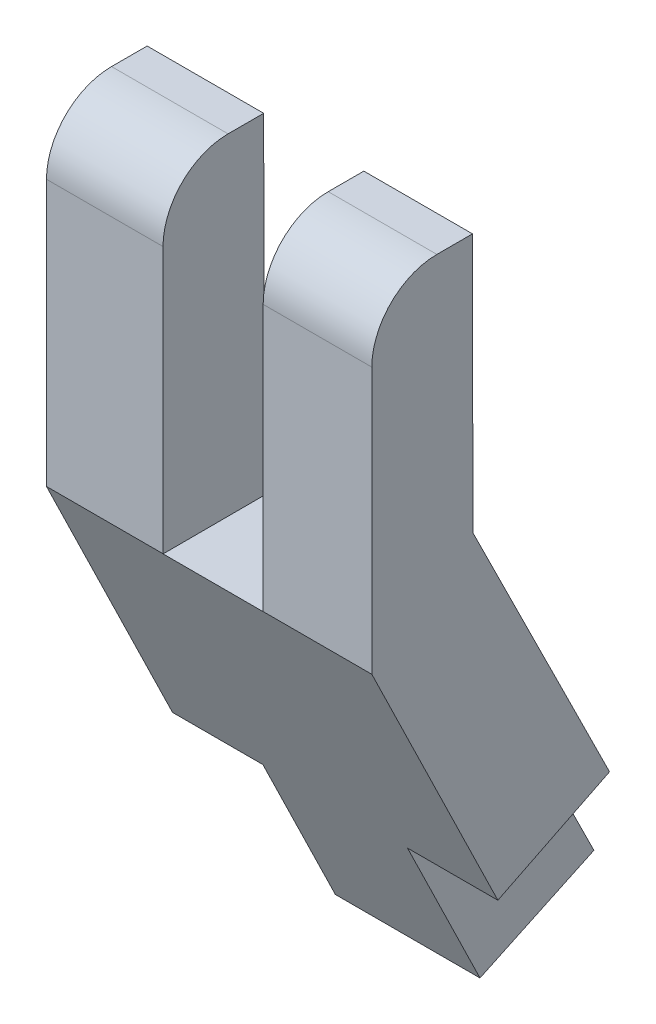
ISO-10303-21;
HEADER;
FILE_DESCRIPTION(('STEP AP214'),'2;1');
FILE_NAME('part.step','',(''),(''),'','','');
FILE_SCHEMA(('AUTOMOTIVE_DESIGN { 1 0 10303 214 1 1 1 1 }'));
ENDSEC;
DATA;
#1=APPLICATION_CONTEXT('core data for automotive mechanical design processes');
#2=APPLICATION_PROTOCOL_DEFINITION('international standard','automotive_design',2000,#1);
#3=PRODUCT_CONTEXT('',#1,'mechanical');
#4=PRODUCT('Part','Part','',(#3));
#5=PRODUCT_RELATED_PRODUCT_CATEGORY('part','',(#4));
#6=PRODUCT_DEFINITION_FORMATION('','',#4);
#7=PRODUCT_DEFINITION_CONTEXT('part definition',#1,'design');
#8=PRODUCT_DEFINITION('design','',#6,#7);
#9=PRODUCT_DEFINITION_SHAPE('','',#8);
#10=(LENGTH_UNIT() NAMED_UNIT(*) SI_UNIT(.MILLI.,.METRE.));
#11=(NAMED_UNIT(*) PLANE_ANGLE_UNIT() SI_UNIT($,.RADIAN.));
#12=(NAMED_UNIT(*) SI_UNIT($,.STERADIAN.) SOLID_ANGLE_UNIT());
#13=UNCERTAINTY_MEASURE_WITH_UNIT(LENGTH_MEASURE(1.E-05),#10,'distance_accuracy_value','');
#14=(GEOMETRIC_REPRESENTATION_CONTEXT(3) GLOBAL_UNCERTAINTY_ASSIGNED_CONTEXT((#13)) GLOBAL_UNIT_ASSIGNED_CONTEXT((#10,
#11,#12)) REPRESENTATION_CONTEXT('',''));
#15=CARTESIAN_POINT('',(0.,0.,0.));
#16=DIRECTION('',(0.,0.,1.));
#17=DIRECTION('',(1.,0.,0.));
#18=AXIS2_PLACEMENT_3D('',#15,#16,#17);
#19=CARTESIAN_POINT('',(4.5,3.04292614968411,3.83808043067269));
#20=DIRECTION('',(0.,0.438003630054975,-0.898973203192768));
#21=DIRECTION('',(0.,0.898973203192768,0.438003630054975));
#22=AXIS2_PLACEMENT_3D('',#19,#20,#21);
#23=PLANE('',#22);
#24=DIRECTION('',(0.,-0.898973203192768,-0.438003630054975));
#25=VECTOR('',#24,1.);
#26=CARTESIAN_POINT('',(3.25,5.08393885452834,4.83251604959335));
#27=LINE('',#26,#25);
#28=CARTESIAN_POINT('',(3.25,5.10041129322718,4.84054185939539));
#29=VERTEX_POINT('',#28);
#30=CARTESIAN_POINT('',(3.25,3.04292614968411,3.83808043067269));
#31=VERTEX_POINT('',#30);
#32=EDGE_CURVE('E168',#29,#31,#27,.T.);
#33=ORIENTED_EDGE('',*,*,#32,.F.);
#34=DIRECTION('',(-1.,0.,0.));
#35=VECTOR('',#34,1.);
#36=CARTESIAN_POINT('',(3.25,5.10041129322718,4.84054185939539));
#37=LINE('',#36,#35);
#38=CARTESIAN_POINT('',(4.5,5.10041129322718,4.84054185939539));
#39=VERTEX_POINT('',#38);
#40=EDGE_CURVE('E163',#39,#29,#37,.T.);
#41=ORIENTED_EDGE('',*,*,#40,.F.);
#42=DIRECTION('',(0.,-0.898973203192767,-0.438003630054975));
#43=VECTOR('',#42,1.);
#44=CARTESIAN_POINT('',(4.5,3.04292614968411,3.83808043067269));
#45=LINE('',#44,#43);
#46=CARTESIAN_POINT('',(4.5,8.67889158146946,6.58407253501909));
#47=VERTEX_POINT('',#46);
#48=EDGE_CURVE('E175',#47,#39,#45,.T.);
#49=ORIENTED_EDGE('',*,*,#48,.F.);
#50=DIRECTION('',(-1.,0.,0.));
#51=VECTOR('',#50,1.);
#52=CARTESIAN_POINT('',(4.5,8.67889158146946,6.58407253501909));
#53=LINE('',#52,#51);
#54=CARTESIAN_POINT('',(2.99704549335491,8.67889158146946,6.58407253501909));
#55=VERTEX_POINT('',#54);
#56=EDGE_CURVE('E211',#47,#55,#53,.T.);
#57=ORIENTED_EDGE('',*,*,#56,.T.);
#58=DIRECTION('',(0.,0.898973203192768,0.438003630054975));
#59=VECTOR('',#58,1.);
#60=CARTESIAN_POINT('',(2.9970454933549,8.68151642383623,6.58535142796149));
#61=LINE('',#60,#59);
#62=CARTESIAN_POINT('',(2.9970454933549,8.67594496847378,6.58263686687694));
#63=VERTEX_POINT('',#62);
#64=EDGE_CURVE('E259',#63,#55,#61,.T.);
#65=ORIENTED_EDGE('',*,*,#64,.F.);
#66=DIRECTION('',(1.,0.,0.));
#67=VECTOR('',#66,1.);
#68=CARTESIAN_POINT('',(2.9970454933549,8.67594496847378,6.58263686687694));
#69=LINE('',#68,#67);
#70=CARTESIAN_POINT('',(1.61182585498931,8.67594496847378,6.58263686687694));
#71=VERTEX_POINT('',#70);
#72=EDGE_CURVE('E260',#71,#63,#69,.T.);
#73=ORIENTED_EDGE('',*,*,#72,.F.);
#74=DIRECTION('',(0.,-0.898973203192768,-0.438003630054975));
#75=VECTOR('',#74,1.);
#76=CARTESIAN_POINT('',(1.61182585498931,8.68151642383623,6.58535142796149));
#77=LINE('',#76,#75);
#78=CARTESIAN_POINT('',(1.61182585498931,8.67889158146946,6.58407253501909));
#79=VERTEX_POINT('',#78);
#80=EDGE_CURVE('E272',#79,#71,#77,.T.);
#81=ORIENTED_EDGE('',*,*,#80,.F.);
#82=CARTESIAN_POINT('',(0.,8.67889158146946,6.58407253501909));
#83=VERTEX_POINT('',#82);
#84=EDGE_CURVE('E200',#79,#83,#53,.T.);
#85=ORIENTED_EDGE('',*,*,#84,.T.);
#86=DIRECTION('',(0.,-0.898973203192767,-0.438003630054975));
#87=VECTOR('',#86,1.);
#88=CARTESIAN_POINT('',(0.,3.04292614968411,3.83808043067269));
#89=LINE('',#88,#87);
#90=CARTESIAN_POINT('',(0.,5.10041129322718,4.84054185939539));
#91=VERTEX_POINT('',#90);
#92=EDGE_CURVE('E201',#83,#91,#89,.T.);
#93=ORIENTED_EDGE('',*,*,#92,.T.);
#94=DIRECTION('',(-1.,0.,0.));
#95=VECTOR('',#94,1.);
#96=CARTESIAN_POINT('',(1.25,5.10041129322718,4.84054185939539));
#97=LINE('',#96,#95);
#98=CARTESIAN_POINT('',(1.25,5.10041129322718,4.84054185939539));
#99=VERTEX_POINT('',#98);
#100=EDGE_CURVE('E61',#99,#91,#97,.T.);
#101=ORIENTED_EDGE('',*,*,#100,.F.);
#102=DIRECTION('',(0.,0.898973203192768,0.438003630054975));
#103=VECTOR('',#102,1.);
#104=CARTESIAN_POINT('',(1.25,5.08393885452834,4.83251604959335));
#105=LINE('',#104,#103);
#106=CARTESIAN_POINT('',(1.25,3.04292614968411,3.83808043067269));
#107=VERTEX_POINT('',#106);
#108=EDGE_CURVE('E476',#107,#99,#105,.T.);
#109=ORIENTED_EDGE('',*,*,#108,.F.);
#110=DIRECTION('',(-1.,0.,0.));
#111=VECTOR('',#110,1.);
#112=CARTESIAN_POINT('',(4.5,3.04292614968411,3.83808043067269));
#113=LINE('',#112,#111);
#114=EDGE_CURVE('E223',#31,#107,#113,.T.);
#115=ORIENTED_EDGE('',*,*,#114,.F.);
#116=EDGE_LOOP('',(#33,#41,#49,#57,#65,#73,#81,#85,#93,#101,#109,#115));
#117=FACE_BOUND('',#116,.T.);
#118=ADVANCED_FACE('F38',(#117),#23,.F.);
#119=CARTESIAN_POINT('',(4.5,3.78454922949705,2.26252963071506));
#120=DIRECTION('',(0.,-0.44463945806678,0.895709636171277));
#121=DIRECTION('',(0.,-0.895709636171277,-0.44463945806678));
#122=AXIS2_PLACEMENT_3D('',#119,#120,#121);
#123=PLANE('',#122);
#124=DIRECTION('',(0.,0.895709636171277,0.44463945806678));
#125=VECTOR('',#124,1.);
#126=CARTESIAN_POINT('',(4.5,3.78454922949705,2.26252963071506));
#127=LINE('',#126,#125);
#128=CARTESIAN_POINT('',(4.5,5.86699915428375,3.2962791502204));
#129=VERTEX_POINT('',#128);
#130=CARTESIAN_POINT('',(4.5,9.6740785639389,5.18615244974419));
#131=VERTEX_POINT('',#130);
#132=EDGE_CURVE('E184',#129,#131,#127,.T.);
#133=ORIENTED_EDGE('',*,*,#132,.F.);
#134=DIRECTION('',(1.,0.,0.));
#135=VECTOR('',#134,1.);
#136=CARTESIAN_POINT('',(3.25,5.86699915428375,3.2962791502204));
#137=LINE('',#136,#135);
#138=CARTESIAN_POINT('',(3.25,5.86699915428375,3.2962791502204));
#139=VERTEX_POINT('',#138);
#140=EDGE_CURVE('E53',#139,#129,#137,.T.);
#141=ORIENTED_EDGE('',*,*,#140,.F.);
#142=DIRECTION('',(0.,0.895709636171277,0.44463945806678));
#143=VECTOR('',#142,1.);
#144=CARTESIAN_POINT('',(3.25,5.86699915428375,3.2962791502204));
#145=LINE('',#144,#143);
#146=CARTESIAN_POINT('',(3.25,3.78454922949705,2.26252963071506));
#147=VERTEX_POINT('',#146);
#148=EDGE_CURVE('E177',#147,#139,#145,.T.);
#149=ORIENTED_EDGE('',*,*,#148,.F.);
#150=DIRECTION('',(-1.,0.,0.));
#151=VECTOR('',#150,1.);
#152=CARTESIAN_POINT('',(4.5,3.78454922949705,2.26252963071506));
#153=LINE('',#152,#151);
#154=CARTESIAN_POINT('',(1.25,3.78454922949705,2.26252963071506));
#155=VERTEX_POINT('',#154);
#156=EDGE_CURVE('E221',#147,#155,#153,.T.);
#157=ORIENTED_EDGE('',*,*,#156,.T.);
#158=DIRECTION('',(0.,-0.895709636171277,-0.44463945806678));
#159=VECTOR('',#158,1.);
#160=CARTESIAN_POINT('',(1.25,5.86699915428375,3.2962791502204));
#161=LINE('',#160,#159);
#162=CARTESIAN_POINT('',(1.25,5.86699915428375,3.2962791502204));
#163=VERTEX_POINT('',#162);
#164=EDGE_CURVE('E478',#163,#155,#161,.T.);
#165=ORIENTED_EDGE('',*,*,#164,.F.);
#166=DIRECTION('',(1.,0.,0.));
#167=VECTOR('',#166,1.);
#168=CARTESIAN_POINT('',(1.25,5.86699915428375,3.2962791502204));
#169=LINE('',#168,#167);
#170=CARTESIAN_POINT('',(0.,5.86699915428375,3.2962791502204));
#171=VERTEX_POINT('',#170);
#172=EDGE_CURVE('E306',#171,#163,#169,.T.);
#173=ORIENTED_EDGE('',*,*,#172,.F.);
#174=DIRECTION('',(0.,0.895709636171277,0.44463945806678));
#175=VECTOR('',#174,1.);
#176=CARTESIAN_POINT('',(0.,3.78454922949705,2.26252963071506));
#177=LINE('',#176,#175);
#178=CARTESIAN_POINT('',(0.,9.6740785639389,5.18615244974419));
#179=VERTEX_POINT('',#178);
#180=EDGE_CURVE('E204',#171,#179,#177,.T.);
#181=ORIENTED_EDGE('',*,*,#180,.T.);
#182=DIRECTION('',(-1.,0.,0.));
#183=VECTOR('',#182,1.);
#184=CARTESIAN_POINT('',(4.5,9.6740785639389,5.18615244974419));
#185=LINE('',#184,#183);
#186=CARTESIAN_POINT('',(1.61182585498931,9.6740785639389,5.18615244974419));
#187=VERTEX_POINT('',#186);
#188=EDGE_CURVE('E217',#187,#179,#185,.T.);
#189=ORIENTED_EDGE('',*,*,#188,.F.);
#190=DIRECTION('',(0.,0.895709636171277,0.44463945806678));
#191=VECTOR('',#190,1.);
#192=CARTESIAN_POINT('',(1.61182585498931,3.78454922949705,2.26252963071506));
#193=LINE('',#192,#191);
#194=CARTESIAN_POINT('',(1.61182585498931,8.67989503427929,4.69262954009198));
#195=VERTEX_POINT('',#194);
#196=EDGE_CURVE('E192',#195,#187,#193,.T.);
#197=ORIENTED_EDGE('',*,*,#196,.F.);
#198=DIRECTION('',(-1.,0.,0.));
#199=VECTOR('',#198,1.);
#200=CARTESIAN_POINT('',(4.5,8.67989503427929,4.69262954009198));
#201=LINE('',#200,#199);
#202=CARTESIAN_POINT('',(2.9970454933549,8.67989503427929,4.69262954009198));
#203=VERTEX_POINT('',#202);
#204=EDGE_CURVE('E225',#203,#195,#201,.T.);
#205=ORIENTED_EDGE('',*,*,#204,.F.);
#206=DIRECTION('',(0.,-0.895709636171277,-0.44463945806678));
#207=VECTOR('',#206,1.);
#208=CARTESIAN_POINT('',(2.99704549335489,3.78454922949705,2.26252963071506));
#209=LINE('',#208,#207);
#210=CARTESIAN_POINT('',(2.99704549335491,9.6740785639389,5.18615244974419));
#211=VERTEX_POINT('',#210);
#212=EDGE_CURVE('E282',#211,#203,#209,.T.);
#213=ORIENTED_EDGE('',*,*,#212,.F.);
#214=EDGE_CURVE('E218',#131,#211,#185,.T.);
#215=ORIENTED_EDGE('',*,*,#214,.F.);
#216=EDGE_LOOP('',(#133,#141,#149,#157,#165,#173,#181,#189,#197,#205,#213,#215));
#217=FACE_BOUND('',#216,.T.);
#218=ADVANCED_FACE('F301',(#217),#123,.F.);
#219=CARTESIAN_POINT('',(4.5,13.2582341197999,5.19154385418615));
#220=DIRECTION('',(0.,-0.00150423112455125,0.999998868643722));
#221=DIRECTION('',(0.,-0.999998868643722,-0.00150423112455125));
#222=AXIS2_PLACEMENT_3D('',#219,#220,#221);
#223=PLANE('',#222);
#224=DIRECTION('',(0.,0.999998868643722,0.00150423112455125));
#225=VECTOR('',#224,1.);
#226=CARTESIAN_POINT('',(1.61182585498931,13.2582341197999,5.19154385418615));
#227=LINE('',#226,#225);
#228=CARTESIAN_POINT('',(1.61182585498931,13.2582341197999,5.19154385418615));
#229=VERTEX_POINT('',#228);
#230=EDGE_CURVE('E286',#187,#229,#227,.T.);
#231=ORIENTED_EDGE('',*,*,#230,.F.);
#232=ORIENTED_EDGE('',*,*,#188,.T.);
#233=DIRECTION('',(0.,0.999998868643722,0.00150423112455125));
#234=VECTOR('',#233,1.);
#235=CARTESIAN_POINT('',(0.,13.2582341197999,5.19154385418615));
#236=LINE('',#235,#234);
#237=CARTESIAN_POINT('',(0.,13.2582341197999,5.19154385418615));
#238=VERTEX_POINT('',#237);
#239=EDGE_CURVE('E206',#179,#238,#236,.T.);
#240=ORIENTED_EDGE('',*,*,#239,.T.);
#241=DIRECTION('',(-1.,0.,0.));
#242=VECTOR('',#241,1.);
#243=CARTESIAN_POINT('',(4.5,13.2582341197999,5.19154385418615));
#244=LINE('',#243,#242);
#245=EDGE_CURVE('E213',#229,#238,#244,.T.);
#246=ORIENTED_EDGE('',*,*,#245,.F.);
#247=EDGE_LOOP('',(#231,#232,#240,#246));
#248=FACE_BOUND('',#247,.T.);
#249=ADVANCED_FACE('F299',(#248),#223,.F.);
#250=DIRECTION('',(0.,-0.999998868643722,-0.00150423112455125));
#251=VECTOR('',#250,1.);
#252=CARTESIAN_POINT('',(2.99704549335492,13.2582341197999,5.19154385418615));
#253=LINE('',#252,#251);
#254=CARTESIAN_POINT('',(2.99704549335492,13.2582341197999,5.19154385418615));
#255=VERTEX_POINT('',#254);
#256=EDGE_CURVE('E280',#255,#211,#253,.T.);
#257=ORIENTED_EDGE('',*,*,#256,.F.);
#258=CARTESIAN_POINT('',(4.5,13.2582341197999,5.19154385418615));
#259=VERTEX_POINT('',#258);
#260=EDGE_CURVE('E214',#259,#255,#244,.T.);
#261=ORIENTED_EDGE('',*,*,#260,.F.);
#262=DIRECTION('',(0.,0.999998868643722,0.00150423112455125));
#263=VECTOR('',#262,1.);
#264=CARTESIAN_POINT('',(4.5,13.2582341197999,5.19154385418615));
#265=LINE('',#264,#263);
#266=EDGE_CURVE('E187',#131,#259,#265,.T.);
#267=ORIENTED_EDGE('',*,*,#266,.F.);
#268=ORIENTED_EDGE('',*,*,#214,.T.);
#269=EDGE_LOOP('',(#257,#261,#267,#268));
#270=FACE_BOUND('',#269,.T.);
#271=ADVANCED_FACE('F333',(#270),#223,.F.);
#272=CARTESIAN_POINT('',(4.5,13.2582341197999,6.58407253501905));
#273=DIRECTION('',(0.,-1.,0.));
#274=DIRECTION('',(0.,0.,-1.));
#275=AXIS2_PLACEMENT_3D('',#272,#273,#274);
#276=PLANE('',#275);
#277=DIRECTION('',(0.,0.,1.));
#278=VECTOR('',#277,1.);
#279=CARTESIAN_POINT('',(0.,13.2582341197999,6.58407253501905));
#280=LINE('',#279,#278);
#281=CARTESIAN_POINT('',(0.,13.2582341197999,5.68407253501906));
#282=VERTEX_POINT('',#281);
#283=EDGE_CURVE('E189',#238,#282,#280,.T.);
#284=ORIENTED_EDGE('',*,*,#283,.T.);
#285=DIRECTION('',(-1.,0.,0.));
#286=VECTOR('',#285,1.);
#287=CARTESIAN_POINT('',(4.5,13.2582341197999,5.68407253501906));
#288=LINE('',#287,#286);
#289=CARTESIAN_POINT('',(1.61182585498931,13.2582341197999,5.68407253501906));
#290=VERTEX_POINT('',#289);
#291=EDGE_CURVE('E232',#282,#290,#288,.F.);
#292=ORIENTED_EDGE('',*,*,#291,.T.);
#293=DIRECTION('',(0.,0.,1.));
#294=VECTOR('',#293,1.);
#295=CARTESIAN_POINT('',(1.61182585498931,13.2582341197999,6.58407253501905));
#296=LINE('',#295,#294);
#297=EDGE_CURVE('E284',#229,#290,#296,.T.);
#298=ORIENTED_EDGE('',*,*,#297,.F.);
#299=ORIENTED_EDGE('',*,*,#245,.T.);
#300=EDGE_LOOP('',(#284,#292,#298,#299));
#301=FACE_BOUND('',#300,.T.);
#302=ADVANCED_FACE('F314',(#301),#276,.F.);
#303=DIRECTION('',(0.,0.,-1.));
#304=VECTOR('',#303,1.);
#305=CARTESIAN_POINT('',(2.99704549335492,13.2582341197999,6.58407253501905));
#306=LINE('',#305,#304);
#307=CARTESIAN_POINT('',(2.99704549335492,13.2582341197999,5.68407253501906));
#308=VERTEX_POINT('',#307);
#309=EDGE_CURVE('E245',#308,#255,#306,.T.);
#310=ORIENTED_EDGE('',*,*,#309,.F.);
#311=DIRECTION('',(-1.,0.,0.));
#312=VECTOR('',#311,1.);
#313=CARTESIAN_POINT('',(4.5,13.2582341197999,5.68407253501906));
#314=LINE('',#313,#312);
#315=CARTESIAN_POINT('',(4.5,13.2582341197999,5.68407253501906));
#316=VERTEX_POINT('',#315);
#317=EDGE_CURVE('E46',#308,#316,#314,.F.);
#318=ORIENTED_EDGE('',*,*,#317,.T.);
#319=DIRECTION('',(0.,0.,1.));
#320=VECTOR('',#319,1.);
#321=CARTESIAN_POINT('',(4.5,13.2582341197999,6.58407253501905));
#322=LINE('',#321,#320);
#323=EDGE_CURVE('E196',#259,#316,#322,.T.);
#324=ORIENTED_EDGE('',*,*,#323,.F.);
#325=ORIENTED_EDGE('',*,*,#260,.T.);
#326=EDGE_LOOP('',(#310,#318,#324,#325));
#327=FACE_BOUND('',#326,.T.);
#328=ADVANCED_FACE('F244',(#327),#276,.F.);
#329=CARTESIAN_POINT('',(4.5,8.67889158146946,6.58407253501909));
#330=DIRECTION('',(0.,0.,-1.));
#331=DIRECTION('',(0.,1.,0.));
#332=AXIS2_PLACEMENT_3D('',#329,#330,#331);
#333=PLANE('',#332);
#334=DIRECTION('',(0.,-1.,0.));
#335=VECTOR('',#334,1.);
#336=CARTESIAN_POINT('',(1.61182585498931,8.67591526878016,6.58407253501909));
#337=LINE('',#336,#335);
#338=CARTESIAN_POINT('',(1.61182585498931,12.3582341197999,6.58407253501906));
#339=VERTEX_POINT('',#338);
#340=EDGE_CURVE('E270',#339,#79,#337,.T.);
#341=ORIENTED_EDGE('',*,*,#340,.F.);
#342=DIRECTION('',(-1.,0.,0.));
#343=VECTOR('',#342,1.);
#344=CARTESIAN_POINT('',(4.5,12.3582341197999,6.58407253501906));
#345=LINE('',#344,#343);
#346=CARTESIAN_POINT('',(0.,12.3582341197999,6.58407253501906));
#347=VERTEX_POINT('',#346);
#348=EDGE_CURVE('E227',#339,#347,#345,.T.);
#349=ORIENTED_EDGE('',*,*,#348,.T.);
#350=DIRECTION('',(0.,-1.,0.));
#351=VECTOR('',#350,1.);
#352=CARTESIAN_POINT('',(0.,8.67889158146946,6.58407253501909));
#353=LINE('',#352,#351);
#354=EDGE_CURVE('E185',#347,#83,#353,.T.);
#355=ORIENTED_EDGE('',*,*,#354,.T.);
#356=ORIENTED_EDGE('',*,*,#84,.F.);
#357=EDGE_LOOP('',(#341,#349,#355,#356));
#358=FACE_BOUND('',#357,.T.);
#359=ADVANCED_FACE('F323',(#358),#333,.F.);
#360=DIRECTION('',(0.,-1.,0.));
#361=VECTOR('',#360,1.);
#362=CARTESIAN_POINT('',(4.5,8.67889158146946,6.58407253501909));
#363=LINE('',#362,#361);
#364=CARTESIAN_POINT('',(4.5,12.3582341197999,6.58407253501906));
#365=VERTEX_POINT('',#364);
#366=EDGE_CURVE('E182',#365,#47,#363,.T.);
#367=ORIENTED_EDGE('',*,*,#366,.F.);
#368=DIRECTION('',(-1.,0.,0.));
#369=VECTOR('',#368,1.);
#370=CARTESIAN_POINT('',(4.5,12.3582341197999,6.58407253501906));
#371=LINE('',#370,#369);
#372=CARTESIAN_POINT('',(2.99704549335491,12.3582341197999,6.58407253501906));
#373=VERTEX_POINT('',#372);
#374=EDGE_CURVE('E236',#365,#373,#371,.T.);
#375=ORIENTED_EDGE('',*,*,#374,.T.);
#376=DIRECTION('',(0.,1.,0.));
#377=VECTOR('',#376,1.);
#378=CARTESIAN_POINT('',(2.9970454933549,8.67591526878016,6.58407253501909));
#379=LINE('',#378,#377);
#380=EDGE_CURVE('E255',#55,#373,#379,.T.);
#381=ORIENTED_EDGE('',*,*,#380,.F.);
#382=ORIENTED_EDGE('',*,*,#56,.F.);
#383=EDGE_LOOP('',(#367,#375,#381,#382));
#384=FACE_BOUND('',#383,.T.);
#385=ADVANCED_FACE('F254',(#384),#333,.F.);
#386=CARTESIAN_POINT('',(4.5,3.78454922949705,2.26252963071506));
#387=DIRECTION('',(0.,0.904777234553414,0.425885143945966));
#388=DIRECTION('',(0.,-0.425885143945966,0.904777234553414));
#389=AXIS2_PLACEMENT_3D('',#386,#387,#388);
#390=PLANE('',#389);
#391=ORIENTED_EDGE('',*,*,#156,.F.);
#392=DIRECTION('',(0.,0.425885143945966,-0.904777234553414));
#393=VECTOR('',#392,1.);
#394=CARTESIAN_POINT('',(3.25,1.97476747601769,6.1073440210147));
#395=LINE('',#394,#393);
#396=EDGE_CURVE('E178',#31,#147,#395,.T.);
#397=ORIENTED_EDGE('',*,*,#396,.F.);
#398=ORIENTED_EDGE('',*,*,#114,.T.);
#399=DIRECTION('',(0.,-0.425885143945966,0.904777234553414));
#400=VECTOR('',#399,1.);
#401=CARTESIAN_POINT('',(1.25,1.97476747601769,6.1073440210147));
#402=LINE('',#401,#400);
#403=EDGE_CURVE('E469',#155,#107,#402,.T.);
#404=ORIENTED_EDGE('',*,*,#403,.F.);
#405=EDGE_LOOP('',(#391,#397,#398,#404));
#406=FACE_BOUND('',#405,.T.);
#407=ADVANCED_FACE('F348',(#406),#390,.F.);
#408=CARTESIAN_POINT('',(4.5,0.,0.));
#409=DIRECTION('',(1.,0.,0.));
#410=DIRECTION('',(0.,0.,-1.));
#411=AXIS2_PLACEMENT_3D('',#408,#409,#410);
#412=PLANE('',#411);
#413=DIRECTION('',(0.,0.44463945806678,-0.895709636171277));
#414=VECTOR('',#413,1.);
#415=CARTESIAN_POINT('',(4.5,3.99864956000666,7.05999985689539));
#416=LINE('',#415,#414);
#417=EDGE_CURVE('E160',#39,#129,#416,.T.);
#418=ORIENTED_EDGE('',*,*,#417,.T.);
#419=ORIENTED_EDGE('',*,*,#132,.T.);
#420=ORIENTED_EDGE('',*,*,#266,.T.);
#421=ORIENTED_EDGE('',*,*,#323,.T.);
#422=CARTESIAN_POINT('',(4.5,12.3582341197999,5.68407253501906));
#423=DIRECTION('',(1.,0.,0.));
#424=DIRECTION('',(0.,0.,-1.));
#425=AXIS2_PLACEMENT_3D('',#422,#423,#424);
#426=CIRCLE('',#425,0.9);
#427=EDGE_CURVE('E11',#316,#365,#426,.T.);
#428=ORIENTED_EDGE('',*,*,#427,.T.);
#429=ORIENTED_EDGE('',*,*,#366,.T.);
#430=ORIENTED_EDGE('',*,*,#48,.T.);
#431=EDGE_LOOP('',(#418,#419,#420,#421,#428,#429,#430));
#432=FACE_BOUND('',#431,.T.);
#433=ADVANCED_FACE('F180',(#432),#412,.T.);
#434=CARTESIAN_POINT('',(0.,0.,0.));
#435=DIRECTION('',(1.,0.,0.));
#436=DIRECTION('',(0.,0.,-1.));
#437=AXIS2_PLACEMENT_3D('',#434,#435,#436);
#438=PLANE('',#437);
#439=ORIENTED_EDGE('',*,*,#180,.F.);
#440=DIRECTION('',(0.,0.44463945806678,-0.895709636171277));
#441=VECTOR('',#440,1.);
#442=CARTESIAN_POINT('',(0.,3.99864956000666,7.05999985689539));
#443=LINE('',#442,#441);
#444=EDGE_CURVE('E265',#91,#171,#443,.T.);
#445=ORIENTED_EDGE('',*,*,#444,.F.);
#446=ORIENTED_EDGE('',*,*,#92,.F.);
#447=ORIENTED_EDGE('',*,*,#354,.F.);
#448=CARTESIAN_POINT('',(0.,12.3582341197999,5.68407253501906));
#449=DIRECTION('',(1.,0.,0.));
#450=DIRECTION('',(0.,0.,-1.));
#451=AXIS2_PLACEMENT_3D('',#448,#449,#450);
#452=CIRCLE('',#451,0.9);
#453=EDGE_CURVE('E230',#347,#282,#452,.F.);
#454=ORIENTED_EDGE('',*,*,#453,.T.);
#455=ORIENTED_EDGE('',*,*,#283,.F.);
#456=ORIENTED_EDGE('',*,*,#239,.F.);
#457=EDGE_LOOP('',(#439,#445,#446,#447,#454,#455,#456));
#458=FACE_BOUND('',#457,.T.);
#459=ADVANCED_FACE('F308',(#458),#438,.F.);
#460=CARTESIAN_POINT('',(2.9970454933549,8.68827279298161,0.684082313537499));
#461=DIRECTION('',(0.,0.999997816011901,0.00208996924119805));
#462=DIRECTION('',(0.,-0.00208996924119805,0.999997816011901));
#463=AXIS2_PLACEMENT_3D('',#460,#461,#462);
#464=PLANE('',#463);
#465=ORIENTED_EDGE('',*,*,#204,.T.);
#466=DIRECTION('',(0.,-0.00208996924119805,0.9999978160119));
#467=VECTOR('',#466,1.);
#468=CARTESIAN_POINT('',(1.61182585498931,8.68827279298161,0.684082313537499));
#469=LINE('',#468,#467);
#470=EDGE_CURVE('E277',#195,#71,#469,.T.);
#471=ORIENTED_EDGE('',*,*,#470,.T.);
#472=ORIENTED_EDGE('',*,*,#72,.T.);
#473=DIRECTION('',(0.,-0.00208996924119805,0.9999978160119));
#474=VECTOR('',#473,1.);
#475=CARTESIAN_POINT('',(2.9970454933549,8.68827279298161,0.684082313537499));
#476=LINE('',#475,#474);
#477=EDGE_CURVE('E275',#203,#63,#476,.T.);
#478=ORIENTED_EDGE('',*,*,#477,.F.);
#479=EDGE_LOOP('',(#465,#471,#472,#478));
#480=FACE_BOUND('',#479,.T.);
#481=ADVANCED_FACE('F328',(#480),#464,.T.);
#482=CARTESIAN_POINT('',(1.61182585498931,8.68827279298161,0.684082313537499));
#483=DIRECTION('',(1.,0.,0.));
#484=DIRECTION('',(0.,0.,-1.));
#485=AXIS2_PLACEMENT_3D('',#482,#483,#484);
#486=PLANE('',#485);
#487=ORIENTED_EDGE('',*,*,#297,.T.);
#488=CARTESIAN_POINT('',(1.61182585498931,12.3582341197999,5.68407253501906));
#489=DIRECTION('',(1.,0.,0.));
#490=DIRECTION('',(0.,0.,-1.));
#491=AXIS2_PLACEMENT_3D('',#488,#489,#490);
#492=CIRCLE('',#491,0.9);
#493=EDGE_CURVE('E234',#290,#339,#492,.T.);
#494=ORIENTED_EDGE('',*,*,#493,.T.);
#495=ORIENTED_EDGE('',*,*,#340,.T.);
#496=ORIENTED_EDGE('',*,*,#80,.T.);
#497=ORIENTED_EDGE('',*,*,#470,.F.);
#498=ORIENTED_EDGE('',*,*,#196,.T.);
#499=ORIENTED_EDGE('',*,*,#230,.T.);
#500=EDGE_LOOP('',(#487,#494,#495,#496,#497,#498,#499));
#501=FACE_BOUND('',#500,.T.);
#502=ADVANCED_FACE('F292',(#501),#486,.T.);
#503=CARTESIAN_POINT('',(2.9970454933549,8.68827279298161,0.684082313537499));
#504=DIRECTION('',(-1.,0.,0.));
#505=DIRECTION('',(0.,-1.,0.));
#506=AXIS2_PLACEMENT_3D('',#503,#504,#505);
#507=PLANE('',#506);
#508=ORIENTED_EDGE('',*,*,#380,.T.);
#509=CARTESIAN_POINT('',(2.99704549335491,12.3582341197999,5.68407253501906));
#510=DIRECTION('',(-1.,0.,0.));
#511=DIRECTION('',(0.,-1.,0.));
#512=AXIS2_PLACEMENT_3D('',#509,#510,#511);
#513=CIRCLE('',#512,0.9);
#514=EDGE_CURVE('E239',#373,#308,#513,.T.);
#515=ORIENTED_EDGE('',*,*,#514,.T.);
#516=ORIENTED_EDGE('',*,*,#309,.T.);
#517=ORIENTED_EDGE('',*,*,#256,.T.);
#518=ORIENTED_EDGE('',*,*,#212,.T.);
#519=ORIENTED_EDGE('',*,*,#477,.T.);
#520=ORIENTED_EDGE('',*,*,#64,.T.);
#521=EDGE_LOOP('',(#508,#515,#516,#517,#518,#519,#520));
#522=FACE_BOUND('',#521,.T.);
#523=ADVANCED_FACE('F257',(#522),#507,.T.);
#524=CARTESIAN_POINT('',(4.5,12.3582341197999,5.68407253501906));
#525=DIRECTION('',(-1.,0.,0.));
#526=DIRECTION('',(0.,0.,1.));
#527=AXIS2_PLACEMENT_3D('',#524,#525,#526);
#528=CYLINDRICAL_SURFACE('',#527,0.9);
#529=ORIENTED_EDGE('',*,*,#493,.F.);
#530=ORIENTED_EDGE('',*,*,#291,.F.);
#531=ORIENTED_EDGE('',*,*,#453,.F.);
#532=ORIENTED_EDGE('',*,*,#348,.F.);
#533=EDGE_LOOP('',(#529,#530,#531,#532));
#534=FACE_BOUND('',#533,.T.);
#535=ADVANCED_FACE('F317',(#534),#528,.T.);
#536=CARTESIAN_POINT('',(4.5,12.3582341197999,5.68407253501906));
#537=DIRECTION('',(-1.,0.,0.));
#538=DIRECTION('',(0.,0.,1.));
#539=AXIS2_PLACEMENT_3D('',#536,#537,#538);
#540=CYLINDRICAL_SURFACE('',#539,0.9);
#541=ORIENTED_EDGE('',*,*,#427,.F.);
#542=ORIENTED_EDGE('',*,*,#317,.F.);
#543=ORIENTED_EDGE('',*,*,#514,.F.);
#544=ORIENTED_EDGE('',*,*,#374,.F.);
#545=EDGE_LOOP('',(#541,#542,#543,#544));
#546=FACE_BOUND('',#545,.T.);
#547=ADVANCED_FACE('F40',(#546),#540,.T.);
#548=CARTESIAN_POINT('',(1.25,3.99864956000666,7.05999985689539));
#549=DIRECTION('',(1.,0.,0.));
#550=DIRECTION('',(0.,0.,-1.));
#551=AXIS2_PLACEMENT_3D('',#548,#549,#550);
#552=PLANE('',#551);
#553=ORIENTED_EDGE('',*,*,#108,.T.);
#554=DIRECTION('',(0.,0.44463945806678,-0.895709636171277));
#555=VECTOR('',#554,1.);
#556=CARTESIAN_POINT('',(1.25,3.99864956000666,7.05999985689539));
#557=LINE('',#556,#555);
#558=EDGE_CURVE('E261',#99,#163,#557,.T.);
#559=ORIENTED_EDGE('',*,*,#558,.T.);
#560=ORIENTED_EDGE('',*,*,#164,.T.);
#561=ORIENTED_EDGE('',*,*,#403,.T.);
#562=EDGE_LOOP('',(#553,#559,#560,#561));
#563=FACE_BOUND('',#562,.T.);
#564=ADVANCED_FACE('F354',(#563),#552,.F.);
#565=CARTESIAN_POINT('',(1.25,3.99864956000666,7.05999985689539));
#566=DIRECTION('',(0.,0.895709636171277,0.44463945806678));
#567=DIRECTION('',(0.,-0.44463945806678,0.895709636171277));
#568=AXIS2_PLACEMENT_3D('',#565,#566,#567);
#569=PLANE('',#568);
#570=ORIENTED_EDGE('',*,*,#100,.T.);
#571=ORIENTED_EDGE('',*,*,#444,.T.);
#572=ORIENTED_EDGE('',*,*,#172,.T.);
#573=ORIENTED_EDGE('',*,*,#558,.F.);
#574=EDGE_LOOP('',(#570,#571,#572,#573));
#575=FACE_BOUND('',#574,.T.);
#576=ADVANCED_FACE('F361',(#575),#569,.F.);
#577=CARTESIAN_POINT('',(3.25,3.99864956000666,7.05999985689539));
#578=DIRECTION('',(0.,0.895709636171277,0.44463945806678));
#579=DIRECTION('',(0.,-0.44463945806678,0.895709636171277));
#580=AXIS2_PLACEMENT_3D('',#577,#578,#579);
#581=PLANE('',#580);
#582=ORIENTED_EDGE('',*,*,#40,.T.);
#583=DIRECTION('',(0.,0.44463945806678,-0.895709636171277));
#584=VECTOR('',#583,1.);
#585=CARTESIAN_POINT('',(3.25,3.99864956000666,7.05999985689539));
#586=LINE('',#585,#584);
#587=EDGE_CURVE('E169',#29,#139,#586,.T.);
#588=ORIENTED_EDGE('',*,*,#587,.T.);
#589=ORIENTED_EDGE('',*,*,#140,.T.);
#590=ORIENTED_EDGE('',*,*,#417,.F.);
#591=EDGE_LOOP('',(#582,#588,#589,#590));
#592=FACE_BOUND('',#591,.T.);
#593=ADVANCED_FACE('F162',(#592),#581,.F.);
#594=CARTESIAN_POINT('',(3.25,3.99864956000666,7.05999985689539));
#595=DIRECTION('',(-1.,0.,0.));
#596=DIRECTION('',(0.,0.,1.));
#597=AXIS2_PLACEMENT_3D('',#594,#595,#596);
#598=PLANE('',#597);
#599=ORIENTED_EDGE('',*,*,#32,.T.);
#600=ORIENTED_EDGE('',*,*,#396,.T.);
#601=ORIENTED_EDGE('',*,*,#148,.T.);
#602=ORIENTED_EDGE('',*,*,#587,.F.);
#603=EDGE_LOOP('',(#599,#600,#601,#602));
#604=FACE_BOUND('',#603,.T.);
#605=ADVANCED_FACE('F453',(#604),#598,.F.);
#606=CLOSED_SHELL('',(#118,#218,#249,#271,#302,#328,#359,#385,#407,#433,#459,#481,#502,#523,
#535,#547,#564,#576,#593,#605));
#607=MANIFOLD_SOLID_BREP('B2',#606);
#608=ADVANCED_BREP_SHAPE_REPRESENTATION('',(#18,#607),#14);
#609=SHAPE_DEFINITION_REPRESENTATION(#9,#608);
ENDSEC;
END-ISO-10303-21;
